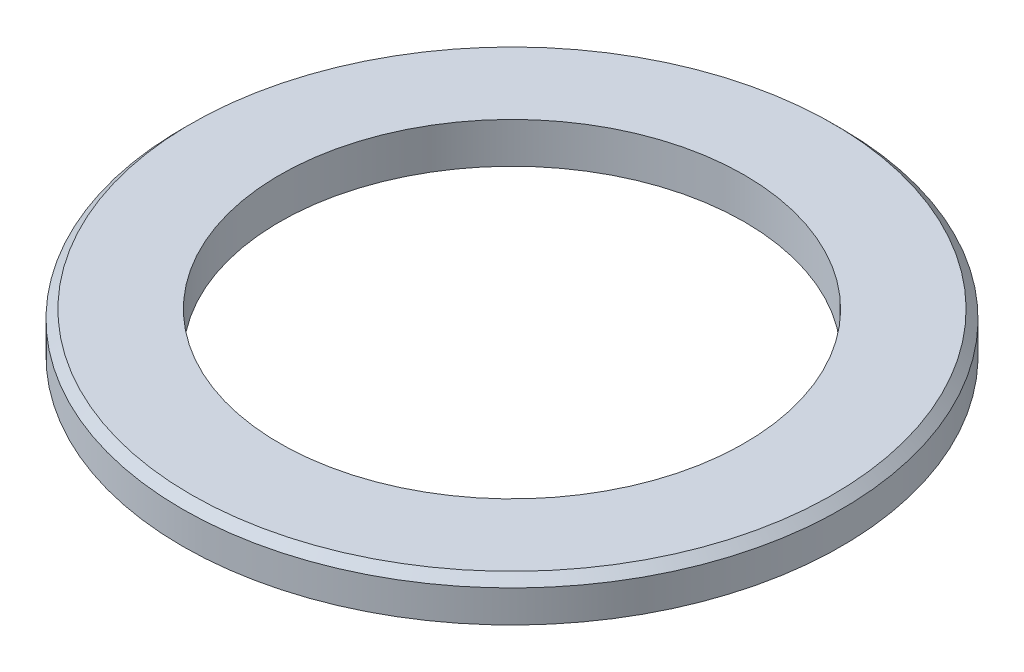
ISO-10303-21;
HEADER;
FILE_DESCRIPTION(('STEP AP214'),'2;1');
FILE_NAME('part.step','',(''),(''),'','','');
FILE_SCHEMA(('AUTOMOTIVE_DESIGN { 1 0 10303 214 1 1 1 1 }'));
ENDSEC;
DATA;
#1=APPLICATION_CONTEXT('core data for automotive mechanical design processes');
#2=APPLICATION_PROTOCOL_DEFINITION('international standard','automotive_design',2000,#1);
#3=PRODUCT_CONTEXT('',#1,'mechanical');
#4=PRODUCT('Part','Part','',(#3));
#5=PRODUCT_RELATED_PRODUCT_CATEGORY('part','',(#4));
#6=PRODUCT_DEFINITION_FORMATION('','',#4);
#7=PRODUCT_DEFINITION_CONTEXT('part definition',#1,'design');
#8=PRODUCT_DEFINITION('design','',#6,#7);
#9=PRODUCT_DEFINITION_SHAPE('','',#8);
#10=(LENGTH_UNIT() NAMED_UNIT(*) SI_UNIT(.MILLI.,.METRE.));
#11=(NAMED_UNIT(*) PLANE_ANGLE_UNIT() SI_UNIT($,.RADIAN.));
#12=(NAMED_UNIT(*) SI_UNIT($,.STERADIAN.) SOLID_ANGLE_UNIT());
#13=UNCERTAINTY_MEASURE_WITH_UNIT(LENGTH_MEASURE(1.E-05),#10,'distance_accuracy_value','');
#14=(GEOMETRIC_REPRESENTATION_CONTEXT(3) GLOBAL_UNCERTAINTY_ASSIGNED_CONTEXT((#13)) GLOBAL_UNIT_ASSIGNED_CONTEXT((#10,
#11,#12)) REPRESENTATION_CONTEXT('',''));
#15=CARTESIAN_POINT('',(0.,0.,0.));
#16=DIRECTION('',(0.,0.,1.));
#17=DIRECTION('',(1.,0.,0.));
#18=AXIS2_PLACEMENT_3D('',#15,#16,#17);
#19=CARTESIAN_POINT('',(0.,0.,0.));
#20=DIRECTION('',(0.,-1.,0.));
#21=DIRECTION('',(0.,0.,-1.));
#22=AXIS2_PLACEMENT_3D('',#19,#20,#21);
#23=CYLINDRICAL_SURFACE('',#22,27.5);
#24=CARTESIAN_POINT('',(0.,0.,0.));
#25=DIRECTION('',(0.,-1.,0.));
#26=DIRECTION('',(0.,0.,-1.));
#27=AXIS2_PLACEMENT_3D('',#24,#25,#26);
#28=CIRCLE('',#27,27.5);
#29=CARTESIAN_POINT('',(0.,0.,-27.5));
#30=VERTEX_POINT('',#29);
#31=EDGE_CURVE('E74',#30,#30,#28,.T.);
#32=ORIENTED_EDGE('',*,*,#31,.T.);
#33=EDGE_LOOP('',(#32));
#34=FACE_BOUND('',#33,.T.);
#35=CARTESIAN_POINT('',(0.,4.8,0.));
#36=DIRECTION('',(0.,-1.,0.));
#37=DIRECTION('',(0.,0.,-1.));
#38=AXIS2_PLACEMENT_3D('',#35,#36,#37);
#39=CIRCLE('',#38,27.5);
#40=CARTESIAN_POINT('',(0.,4.8,-27.5));
#41=VERTEX_POINT('',#40);
#42=EDGE_CURVE('E57',#41,#41,#39,.T.);
#43=ORIENTED_EDGE('',*,*,#42,.F.);
#44=EDGE_LOOP('',(#43));
#45=FACE_BOUND('',#44,.T.);
#46=ADVANCED_FACE('F41',(#34,#45),#23,.F.);
#47=CARTESIAN_POINT('',(39.,4.8,0.));
#48=DIRECTION('',(0.,1.,0.));
#49=DIRECTION('',(0.,0.,1.));
#50=AXIS2_PLACEMENT_3D('',#47,#48,#49);
#51=PLANE('',#50);
#52=CARTESIAN_POINT('',(0.,4.8,0.));
#53=DIRECTION('',(0.,1.,0.));
#54=DIRECTION('',(0.,0.,1.));
#55=AXIS2_PLACEMENT_3D('',#52,#53,#54);
#56=CIRCLE('',#55,38.);
#57=CARTESIAN_POINT('',(0.,4.8,38.));
#58=VERTEX_POINT('',#57);
#59=EDGE_CURVE('E10',#58,#58,#56,.T.);
#60=ORIENTED_EDGE('',*,*,#59,.T.);
#61=EDGE_LOOP('',(#60));
#62=FACE_BOUND('',#61,.T.);
#63=ORIENTED_EDGE('',*,*,#42,.T.);
#64=EDGE_LOOP('',(#63));
#65=FACE_BOUND('',#64,.T.);
#66=ADVANCED_FACE('F97',(#62,#65),#51,.T.);
#67=CARTESIAN_POINT('',(0.,0.,0.));
#68=DIRECTION('',(0.,-1.,0.));
#69=DIRECTION('',(0.,0.,-1.));
#70=AXIS2_PLACEMENT_3D('',#67,#68,#69);
#71=CYLINDRICAL_SURFACE('',#70,39.);
#72=CARTESIAN_POINT('',(0.,3.80000000000002,0.));
#73=DIRECTION('',(0.,1.,0.));
#74=DIRECTION('',(0.,0.,1.));
#75=AXIS2_PLACEMENT_3D('',#72,#73,#74);
#76=CIRCLE('',#75,39.);
#77=CARTESIAN_POINT('',(0.,3.80000000000002,39.));
#78=VERTEX_POINT('',#77);
#79=EDGE_CURVE('E50',#78,#78,#76,.F.);
#80=ORIENTED_EDGE('',*,*,#79,.T.);
#81=EDGE_LOOP('',(#80));
#82=FACE_BOUND('',#81,.T.);
#83=CARTESIAN_POINT('',(0.,0.,0.));
#84=DIRECTION('',(0.,-1.,0.));
#85=DIRECTION('',(0.,0.,-1.));
#86=AXIS2_PLACEMENT_3D('',#83,#84,#85);
#87=CIRCLE('',#86,39.);
#88=CARTESIAN_POINT('',(0.,0.,-39.));
#89=VERTEX_POINT('',#88);
#90=EDGE_CURVE('E61',#89,#89,#87,.T.);
#91=ORIENTED_EDGE('',*,*,#90,.F.);
#92=EDGE_LOOP('',(#91));
#93=FACE_BOUND('',#92,.T.);
#94=ADVANCED_FACE('F101',(#82,#93),#71,.T.);
#95=CARTESIAN_POINT('',(34.3995069679033,0.,0.));
#96=DIRECTION('',(0.,-1.,0.));
#97=DIRECTION('',(0.,0.,-1.));
#98=AXIS2_PLACEMENT_3D('',#95,#96,#97);
#99=PLANE('',#98);
#100=ORIENTED_EDGE('',*,*,#90,.T.);
#101=EDGE_LOOP('',(#100));
#102=FACE_BOUND('',#101,.T.);
#103=CARTESIAN_POINT('',(0.,0.,0.));
#104=DIRECTION('',(0.,-1.,0.));
#105=DIRECTION('',(0.,0.,-1.));
#106=AXIS2_PLACEMENT_3D('',#103,#104,#105);
#107=CIRCLE('',#106,34.3995069679033);
#108=CARTESIAN_POINT('',(0.,0.,-34.3995069679033));
#109=VERTEX_POINT('',#108);
#110=EDGE_CURVE('E67',#109,#109,#107,.T.);
#111=ORIENTED_EDGE('',*,*,#110,.F.);
#112=EDGE_LOOP('',(#111));
#113=FACE_BOUND('',#112,.T.);
#114=ADVANCED_FACE('F93',(#102,#113),#99,.T.);
#115=CARTESIAN_POINT('',(0.,-3.31967836256731,0.));
#116=DIRECTION('',(0.,-1.,0.));
#117=DIRECTION('',(0.,0.,-1.));
#118=AXIS2_PLACEMENT_3D('',#115,#116,#117);
#119=TOROIDAL_SURFACE('',#118,32.1679748554069,4.);
#120=ORIENTED_EDGE('',*,*,#110,.T.);
#121=EDGE_LOOP('',(#120));
#122=FACE_BOUND('',#121,.T.);
#123=CARTESIAN_POINT('',(0.,0.,0.));
#124=DIRECTION('',(0.,-1.,0.));
#125=DIRECTION('',(0.,0.,-1.));
#126=AXIS2_PLACEMENT_3D('',#123,#124,#125);
#127=CIRCLE('',#126,29.9364427429106);
#128=CARTESIAN_POINT('',(0.,0.,-29.9364427429106));
#129=VERTEX_POINT('',#128);
#130=EDGE_CURVE('E70',#129,#129,#127,.T.);
#131=ORIENTED_EDGE('',*,*,#130,.F.);
#132=EDGE_LOOP('',(#131));
#133=FACE_BOUND('',#132,.T.);
#134=ADVANCED_FACE('F85',(#122,#133),#119,.F.);
#135=CARTESIAN_POINT('',(27.5,0.,0.));
#136=DIRECTION('',(0.,-1.,0.));
#137=DIRECTION('',(0.,0.,-1.));
#138=AXIS2_PLACEMENT_3D('',#135,#136,#137);
#139=PLANE('',#138);
#140=ORIENTED_EDGE('',*,*,#130,.T.);
#141=EDGE_LOOP('',(#140));
#142=FACE_BOUND('',#141,.T.);
#143=ORIENTED_EDGE('',*,*,#31,.F.);
#144=EDGE_LOOP('',(#143));
#145=FACE_BOUND('',#144,.T.);
#146=ADVANCED_FACE('F83',(#142,#145),#139,.T.);
#147=CARTESIAN_POINT('',(0.,3.80000000000002,0.));
#148=DIRECTION('',(0.,-1.,0.));
#149=DIRECTION('',(0.,0.,-1.));
#150=AXIS2_PLACEMENT_3D('',#147,#148,#149);
#151=CONICAL_SURFACE('',#150,39.,0.785398163397455);
#152=ORIENTED_EDGE('',*,*,#59,.F.);
#153=EDGE_LOOP('',(#152));
#154=FACE_BOUND('',#153,.T.);
#155=ORIENTED_EDGE('',*,*,#79,.F.);
#156=EDGE_LOOP('',(#155));
#157=FACE_BOUND('',#156,.T.);
#158=ADVANCED_FACE('F44',(#154,#157),#151,.T.);
#159=CLOSED_SHELL('',(#46,#66,#94,#114,#134,#146,#158));
#160=MANIFOLD_SOLID_BREP('B2',#159);
#161=ADVANCED_BREP_SHAPE_REPRESENTATION('',(#18,#160),#14);
#162=SHAPE_DEFINITION_REPRESENTATION(#9,#161);
ENDSEC;
END-ISO-10303-21;
